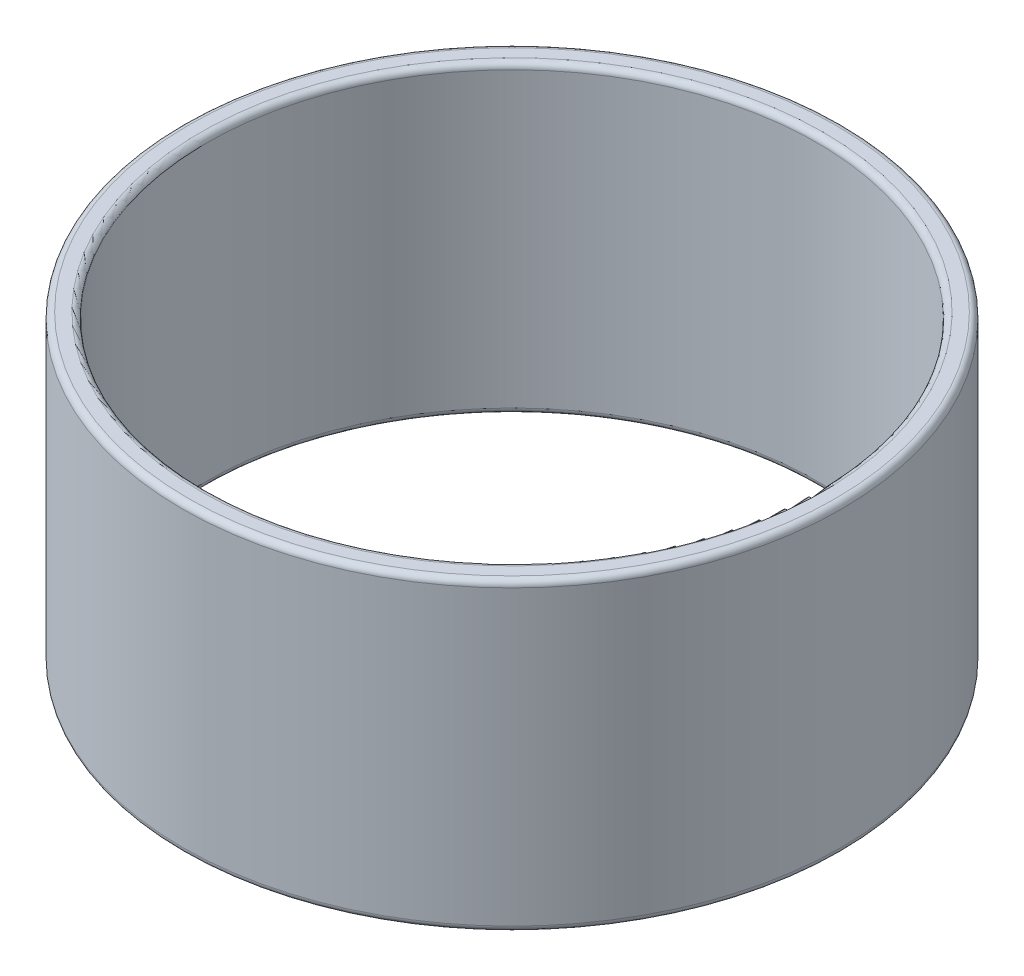
ISO-10303-21;
HEADER;
FILE_DESCRIPTION(('STEP AP214'),'2;1');
FILE_NAME('part.step','',(''),(''),'','','');
FILE_SCHEMA(('AUTOMOTIVE_DESIGN { 1 0 10303 214 1 1 1 1 }'));
ENDSEC;
DATA;
#1=APPLICATION_CONTEXT('core data for automotive mechanical design processes');
#2=APPLICATION_PROTOCOL_DEFINITION('international standard','automotive_design',2000,#1);
#3=PRODUCT_CONTEXT('',#1,'mechanical');
#4=PRODUCT('Part','Part','',(#3));
#5=PRODUCT_RELATED_PRODUCT_CATEGORY('part','',(#4));
#6=PRODUCT_DEFINITION_FORMATION('','',#4);
#7=PRODUCT_DEFINITION_CONTEXT('part definition',#1,'design');
#8=PRODUCT_DEFINITION('design','',#6,#7);
#9=PRODUCT_DEFINITION_SHAPE('','',#8);
#10=(LENGTH_UNIT() NAMED_UNIT(*) SI_UNIT(.MILLI.,.METRE.));
#11=(NAMED_UNIT(*) PLANE_ANGLE_UNIT() SI_UNIT($,.RADIAN.));
#12=(NAMED_UNIT(*) SI_UNIT($,.STERADIAN.) SOLID_ANGLE_UNIT());
#13=UNCERTAINTY_MEASURE_WITH_UNIT(LENGTH_MEASURE(1.E-05),#10,'distance_accuracy_value','');
#14=(GEOMETRIC_REPRESENTATION_CONTEXT(3) GLOBAL_UNCERTAINTY_ASSIGNED_CONTEXT((#13)) GLOBAL_UNIT_ASSIGNED_CONTEXT((#10,
#11,#12)) REPRESENTATION_CONTEXT('',''));
#15=CARTESIAN_POINT('',(0.,0.,0.));
#16=DIRECTION('',(0.,0.,1.));
#17=DIRECTION('',(1.,0.,0.));
#18=AXIS2_PLACEMENT_3D('',#15,#16,#17);
#19=CARTESIAN_POINT('',(0.,25.,0.));
#20=DIRECTION('',(0.,1.,0.));
#21=DIRECTION('',(0.,0.,1.));
#22=AXIS2_PLACEMENT_3D('',#19,#20,#21);
#23=PLANE('',#22);
#24=CARTESIAN_POINT('',(0.,25.,0.));
#25=DIRECTION('',(0.,1.,0.));
#26=DIRECTION('',(0.,0.,1.));
#27=AXIS2_PLACEMENT_3D('',#24,#25,#26);
#28=CIRCLE('',#27,25.5);
#29=CARTESIAN_POINT('',(0.,25.,25.5));
#30=VERTEX_POINT('',#29);
#31=EDGE_CURVE('E10',#30,#30,#28,.F.);
#32=ORIENTED_EDGE('',*,*,#31,.T.);
#33=EDGE_LOOP('',(#32));
#34=FACE_BOUND('',#33,.T.);
#35=CARTESIAN_POINT('',(0.,25.,0.));
#36=DIRECTION('',(0.,1.,0.));
#37=DIRECTION('',(0.,0.,1.));
#38=AXIS2_PLACEMENT_3D('',#35,#36,#37);
#39=CIRCLE('',#38,26.5);
#40=CARTESIAN_POINT('',(0.,25.,26.5));
#41=VERTEX_POINT('',#40);
#42=EDGE_CURVE('E39',#41,#41,#39,.T.);
#43=ORIENTED_EDGE('',*,*,#42,.T.);
#44=EDGE_LOOP('',(#43));
#45=FACE_BOUND('',#44,.T.);
#46=ADVANCED_FACE('F32',(#34,#45),#23,.T.);
#47=CARTESIAN_POINT('',(0.,0.,0.));
#48=DIRECTION('',(0.,1.,0.));
#49=DIRECTION('',(0.,0.,1.));
#50=AXIS2_PLACEMENT_3D('',#47,#48,#49);
#51=PLANE('',#50);
#52=CARTESIAN_POINT('',(0.,0.,0.));
#53=DIRECTION('',(0.,1.,0.));
#54=DIRECTION('',(0.,0.,1.));
#55=AXIS2_PLACEMENT_3D('',#52,#53,#54);
#56=CIRCLE('',#55,25.5);
#57=CARTESIAN_POINT('',(0.,0.,25.5));
#58=VERTEX_POINT('',#57);
#59=EDGE_CURVE('E58',#58,#58,#56,.T.);
#60=ORIENTED_EDGE('',*,*,#59,.T.);
#61=EDGE_LOOP('',(#60));
#62=FACE_BOUND('',#61,.T.);
#63=CARTESIAN_POINT('',(0.,0.,0.));
#64=DIRECTION('',(0.,1.,0.));
#65=DIRECTION('',(0.,0.,1.));
#66=AXIS2_PLACEMENT_3D('',#63,#64,#65);
#67=CIRCLE('',#66,26.5);
#68=CARTESIAN_POINT('',(0.,0.,26.5));
#69=VERTEX_POINT('',#68);
#70=EDGE_CURVE('E61',#69,#69,#67,.F.);
#71=ORIENTED_EDGE('',*,*,#70,.T.);
#72=EDGE_LOOP('',(#71));
#73=FACE_BOUND('',#72,.T.);
#74=ADVANCED_FACE('F65',(#62,#73),#51,.F.);
#75=CARTESIAN_POINT('',(0.,25.,0.));
#76=DIRECTION('',(0.,-1.,0.));
#77=DIRECTION('',(0.,0.,-1.));
#78=AXIS2_PLACEMENT_3D('',#75,#76,#77);
#79=CYLINDRICAL_SURFACE('',#78,27.);
#80=CARTESIAN_POINT('',(0.,0.5,0.));
#81=DIRECTION('',(0.,1.,0.));
#82=DIRECTION('',(0.,0.,1.));
#83=AXIS2_PLACEMENT_3D('',#80,#81,#82);
#84=CIRCLE('',#83,27.);
#85=CARTESIAN_POINT('',(0.,0.5,27.));
#86=VERTEX_POINT('',#85);
#87=EDGE_CURVE('E43',#86,#86,#84,.T.);
#88=ORIENTED_EDGE('',*,*,#87,.T.);
#89=EDGE_LOOP('',(#88));
#90=FACE_BOUND('',#89,.T.);
#91=CARTESIAN_POINT('',(0.,24.5,0.));
#92=DIRECTION('',(0.,1.,0.));
#93=DIRECTION('',(0.,0.,1.));
#94=AXIS2_PLACEMENT_3D('',#91,#92,#93);
#95=CIRCLE('',#94,27.);
#96=CARTESIAN_POINT('',(0.,24.5,27.));
#97=VERTEX_POINT('',#96);
#98=EDGE_CURVE('E47',#97,#97,#95,.F.);
#99=ORIENTED_EDGE('',*,*,#98,.T.);
#100=EDGE_LOOP('',(#99));
#101=FACE_BOUND('',#100,.T.);
#102=ADVANCED_FACE('F75',(#90,#101),#79,.T.);
#103=CARTESIAN_POINT('',(0.,25.,0.));
#104=DIRECTION('',(0.,-1.,0.));
#105=DIRECTION('',(0.,0.,-1.));
#106=AXIS2_PLACEMENT_3D('',#103,#104,#105);
#107=CYLINDRICAL_SURFACE('',#106,25.);
#108=CARTESIAN_POINT('',(0.,0.5,0.));
#109=DIRECTION('',(0.,1.,0.));
#110=DIRECTION('',(0.,0.,1.));
#111=AXIS2_PLACEMENT_3D('',#108,#109,#110);
#112=CIRCLE('',#111,25.);
#113=CARTESIAN_POINT('',(0.,0.5,25.));
#114=VERTEX_POINT('',#113);
#115=EDGE_CURVE('E52',#114,#114,#112,.F.);
#116=ORIENTED_EDGE('',*,*,#115,.T.);
#117=EDGE_LOOP('',(#116));
#118=FACE_BOUND('',#117,.T.);
#119=CARTESIAN_POINT('',(0.,24.5,0.));
#120=DIRECTION('',(0.,1.,0.));
#121=DIRECTION('',(0.,0.,1.));
#122=AXIS2_PLACEMENT_3D('',#119,#120,#121);
#123=CIRCLE('',#122,25.);
#124=CARTESIAN_POINT('',(0.,24.5,25.));
#125=VERTEX_POINT('',#124);
#126=EDGE_CURVE('E55',#125,#125,#123,.T.);
#127=ORIENTED_EDGE('',*,*,#126,.T.);
#128=EDGE_LOOP('',(#127));
#129=FACE_BOUND('',#128,.T.);
#130=ADVANCED_FACE('F78',(#118,#129),#107,.F.);
#131=CARTESIAN_POINT('',(0.,0.5,0.));
#132=DIRECTION('',(0.,1.,0.));
#133=DIRECTION('',(0.,0.,1.));
#134=AXIS2_PLACEMENT_3D('',#131,#132,#133);
#135=TOROIDAL_SURFACE('',#134,25.5,0.5);
#136=ORIENTED_EDGE('',*,*,#115,.F.);
#137=EDGE_LOOP('',(#136));
#138=FACE_BOUND('',#137,.T.);
#139=ORIENTED_EDGE('',*,*,#59,.F.);
#140=EDGE_LOOP('',(#139));
#141=FACE_BOUND('',#140,.T.);
#142=ADVANCED_FACE('F71',(#138,#141),#135,.T.);
#143=CARTESIAN_POINT('',(0.,0.5,0.));
#144=DIRECTION('',(0.,1.,0.));
#145=DIRECTION('',(0.,0.,1.));
#146=AXIS2_PLACEMENT_3D('',#143,#144,#145);
#147=TOROIDAL_SURFACE('',#146,26.5,0.5);
#148=ORIENTED_EDGE('',*,*,#70,.F.);
#149=EDGE_LOOP('',(#148));
#150=FACE_BOUND('',#149,.T.);
#151=ORIENTED_EDGE('',*,*,#87,.F.);
#152=EDGE_LOOP('',(#151));
#153=FACE_BOUND('',#152,.T.);
#154=ADVANCED_FACE('F67',(#150,#153),#147,.T.);
#155=CARTESIAN_POINT('',(0.,24.5,0.));
#156=DIRECTION('',(0.,1.,0.));
#157=DIRECTION('',(0.,0.,1.));
#158=AXIS2_PLACEMENT_3D('',#155,#156,#157);
#159=TOROIDAL_SURFACE('',#158,25.5,0.5);
#160=ORIENTED_EDGE('',*,*,#31,.F.);
#161=EDGE_LOOP('',(#160));
#162=FACE_BOUND('',#161,.T.);
#163=ORIENTED_EDGE('',*,*,#126,.F.);
#164=EDGE_LOOP('',(#163));
#165=FACE_BOUND('',#164,.T.);
#166=ADVANCED_FACE('F70',(#162,#165),#159,.T.);
#167=CARTESIAN_POINT('',(0.,24.5,0.));
#168=DIRECTION('',(0.,1.,0.));
#169=DIRECTION('',(0.,0.,1.));
#170=AXIS2_PLACEMENT_3D('',#167,#168,#169);
#171=TOROIDAL_SURFACE('',#170,26.5,0.5);
#172=ORIENTED_EDGE('',*,*,#98,.F.);
#173=EDGE_LOOP('',(#172));
#174=FACE_BOUND('',#173,.T.);
#175=ORIENTED_EDGE('',*,*,#42,.F.);
#176=EDGE_LOOP('',(#175));
#177=FACE_BOUND('',#176,.T.);
#178=ADVANCED_FACE('F34',(#174,#177),#171,.T.);
#179=CLOSED_SHELL('',(#46,#74,#102,#130,#142,#154,#166,#178));
#180=MANIFOLD_SOLID_BREP('B2',#179);
#181=ADVANCED_BREP_SHAPE_REPRESENTATION('',(#18,#180),#14);
#182=SHAPE_DEFINITION_REPRESENTATION(#9,#181);
ENDSEC;
END-ISO-10303-21;
